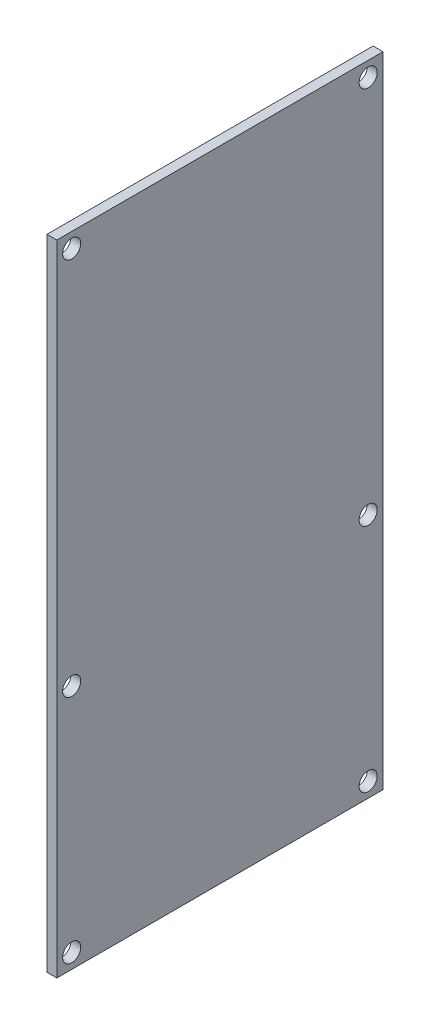
ISO-10303-21;
HEADER;
FILE_DESCRIPTION(('STEP AP214'),'2;1');
FILE_NAME('part.step','',(''),(''),'','','');
FILE_SCHEMA(('AUTOMOTIVE_DESIGN { 1 0 10303 214 1 1 1 1 }'));
ENDSEC;
DATA;
#1=APPLICATION_CONTEXT('core data for automotive mechanical design processes');
#2=APPLICATION_PROTOCOL_DEFINITION('international standard','automotive_design',2000,#1);
#3=PRODUCT_CONTEXT('',#1,'mechanical');
#4=PRODUCT('Part','Part','',(#3));
#5=PRODUCT_RELATED_PRODUCT_CATEGORY('part','',(#4));
#6=PRODUCT_DEFINITION_FORMATION('','',#4);
#7=PRODUCT_DEFINITION_CONTEXT('part definition',#1,'design');
#8=PRODUCT_DEFINITION('design','',#6,#7);
#9=PRODUCT_DEFINITION_SHAPE('','',#8);
#10=(LENGTH_UNIT() NAMED_UNIT(*) SI_UNIT(.MILLI.,.METRE.));
#11=(NAMED_UNIT(*) PLANE_ANGLE_UNIT() SI_UNIT($,.RADIAN.));
#12=(NAMED_UNIT(*) SI_UNIT($,.STERADIAN.) SOLID_ANGLE_UNIT());
#13=UNCERTAINTY_MEASURE_WITH_UNIT(LENGTH_MEASURE(1.E-05),#10,'distance_accuracy_value','');
#14=(GEOMETRIC_REPRESENTATION_CONTEXT(3) GLOBAL_UNCERTAINTY_ASSIGNED_CONTEXT((#13)) GLOBAL_UNIT_ASSIGNED_CONTEXT((#10,
#11,#12)) REPRESENTATION_CONTEXT('',''));
#15=CARTESIAN_POINT('',(0.,0.,0.));
#16=DIRECTION('',(0.,0.,1.));
#17=DIRECTION('',(1.,0.,0.));
#18=AXIS2_PLACEMENT_3D('',#15,#16,#17);
#19=CARTESIAN_POINT('',(48.0117160697982,104.500000000016,33.2693427308272));
#20=DIRECTION('',(0.,-1.,0.));
#21=DIRECTION('',(0.,0.,-1.));
#22=AXIS2_PLACEMENT_3D('',#19,#20,#21);
#23=PLANE('',#22);
#24=DIRECTION('',(0.,0.,1.));
#25=VECTOR('',#24,1.);
#26=CARTESIAN_POINT('',(45.0117160697982,104.500000000016,33.2693427308272));
#27=LINE('',#26,#25);
#28=CARTESIAN_POINT('',(45.0117160697983,104.500000000016,-65.7306572691728));
#29=VERTEX_POINT('',#28);
#30=CARTESIAN_POINT('',(45.0117160697982,104.500000000016,33.2693427308272));
#31=VERTEX_POINT('',#30);
#32=EDGE_CURVE('E96',#29,#31,#27,.T.);
#33=ORIENTED_EDGE('',*,*,#32,.T.);
#34=DIRECTION('',(-1.,0.,0.));
#35=VECTOR('',#34,1.);
#36=CARTESIAN_POINT('',(48.0117160697982,104.500000000016,33.2693427308272));
#37=LINE('',#36,#35);
#38=CARTESIAN_POINT('',(48.0117160697982,104.500000000016,33.2693427308272));
#39=VERTEX_POINT('',#38);
#40=EDGE_CURVE('E11',#39,#31,#37,.T.);
#41=ORIENTED_EDGE('',*,*,#40,.F.);
#42=DIRECTION('',(0.,0.,1.));
#43=VECTOR('',#42,1.);
#44=CARTESIAN_POINT('',(48.0117160697982,104.500000000016,33.2693427308272));
#45=LINE('',#44,#43);
#46=CARTESIAN_POINT('',(48.0117160697983,104.500000000016,-65.7306572691728));
#47=VERTEX_POINT('',#46);
#48=EDGE_CURVE('E84',#47,#39,#45,.T.);
#49=ORIENTED_EDGE('',*,*,#48,.F.);
#50=DIRECTION('',(-1.,0.,0.));
#51=VECTOR('',#50,1.);
#52=CARTESIAN_POINT('',(48.0117160697983,104.500000000016,-65.7306572691728));
#53=LINE('',#52,#51);
#54=EDGE_CURVE('E92',#47,#29,#53,.T.);
#55=ORIENTED_EDGE('',*,*,#54,.T.);
#56=EDGE_LOOP('',(#33,#41,#49,#55));
#57=FACE_BOUND('',#56,.T.);
#58=ADVANCED_FACE('F33',(#57),#23,.F.);
#59=CARTESIAN_POINT('',(48.0117160697982,104.500000000016,33.2693427308272));
#60=DIRECTION('',(0.,0.,-1.));
#61=DIRECTION('',(-1.,0.,0.));
#62=AXIS2_PLACEMENT_3D('',#59,#60,#61);
#63=PLANE('',#62);
#64=DIRECTION('',(0.,-1.,0.));
#65=VECTOR('',#64,1.);
#66=CARTESIAN_POINT('',(45.0117160697982,104.500000000016,33.2693427308272));
#67=LINE('',#66,#65);
#68=CARTESIAN_POINT('',(45.0117160697982,-89.4999999999837,33.2693427308272));
#69=VERTEX_POINT('',#68);
#70=EDGE_CURVE('E88',#31,#69,#67,.T.);
#71=ORIENTED_EDGE('',*,*,#70,.T.);
#72=DIRECTION('',(-1.,0.,0.));
#73=VECTOR('',#72,1.);
#74=CARTESIAN_POINT('',(48.0117160697982,-89.4999999999837,33.2693427308272));
#75=LINE('',#74,#73);
#76=CARTESIAN_POINT('',(48.0117160697982,-89.4999999999837,33.2693427308272));
#77=VERTEX_POINT('',#76);
#78=EDGE_CURVE('E41',#77,#69,#75,.T.);
#79=ORIENTED_EDGE('',*,*,#78,.F.);
#80=DIRECTION('',(0.,-1.,0.));
#81=VECTOR('',#80,1.);
#82=CARTESIAN_POINT('',(48.0117160697982,104.500000000016,33.2693427308272));
#83=LINE('',#82,#81);
#84=EDGE_CURVE('E79',#39,#77,#83,.T.);
#85=ORIENTED_EDGE('',*,*,#84,.F.);
#86=ORIENTED_EDGE('',*,*,#40,.T.);
#87=EDGE_LOOP('',(#71,#79,#85,#86));
#88=FACE_BOUND('',#87,.T.);
#89=ADVANCED_FACE('F87',(#88),#63,.F.);
#90=CARTESIAN_POINT('',(48.0117160697982,-89.4999999999837,33.2693427308272));
#91=DIRECTION('',(0.,1.,0.));
#92=DIRECTION('',(0.,0.,1.));
#93=AXIS2_PLACEMENT_3D('',#90,#91,#92);
#94=PLANE('',#93);
#95=DIRECTION('',(0.,0.,-1.));
#96=VECTOR('',#95,1.);
#97=CARTESIAN_POINT('',(45.0117160697982,-89.4999999999837,33.2693427308272));
#98=LINE('',#97,#96);
#99=CARTESIAN_POINT('',(45.0117160697983,-89.4999999999837,-65.7306572691728));
#100=VERTEX_POINT('',#99);
#101=EDGE_CURVE('E66',#69,#100,#98,.T.);
#102=ORIENTED_EDGE('',*,*,#101,.T.);
#103=DIRECTION('',(-1.,0.,0.));
#104=VECTOR('',#103,1.);
#105=CARTESIAN_POINT('',(48.0117160697983,-89.4999999999837,-65.7306572691728));
#106=LINE('',#105,#104);
#107=CARTESIAN_POINT('',(48.0117160697983,-89.4999999999837,-65.7306572691728));
#108=VERTEX_POINT('',#107);
#109=EDGE_CURVE('E89',#108,#100,#106,.T.);
#110=ORIENTED_EDGE('',*,*,#109,.F.);
#111=DIRECTION('',(0.,0.,-1.));
#112=VECTOR('',#111,1.);
#113=CARTESIAN_POINT('',(48.0117160697982,-89.4999999999837,33.2693427308272));
#114=LINE('',#113,#112);
#115=EDGE_CURVE('E82',#77,#108,#114,.T.);
#116=ORIENTED_EDGE('',*,*,#115,.F.);
#117=ORIENTED_EDGE('',*,*,#78,.T.);
#118=EDGE_LOOP('',(#102,#110,#116,#117));
#119=FACE_BOUND('',#118,.T.);
#120=ADVANCED_FACE('F90',(#119),#94,.F.);
#121=CARTESIAN_POINT('',(48.0117160697983,104.500000000016,-65.7306572691728));
#122=DIRECTION('',(0.,0.,1.));
#123=DIRECTION('',(1.,0.,0.));
#124=AXIS2_PLACEMENT_3D('',#121,#122,#123);
#125=PLANE('',#124);
#126=DIRECTION('',(0.,1.,0.));
#127=VECTOR('',#126,1.);
#128=CARTESIAN_POINT('',(45.0117160697983,104.500000000016,-65.7306572691728));
#129=LINE('',#128,#127);
#130=EDGE_CURVE('E72',#100,#29,#129,.T.);
#131=ORIENTED_EDGE('',*,*,#130,.T.);
#132=ORIENTED_EDGE('',*,*,#54,.F.);
#133=DIRECTION('',(0.,1.,0.));
#134=VECTOR('',#133,1.);
#135=CARTESIAN_POINT('',(48.0117160697983,104.500000000016,-65.7306572691728));
#136=LINE('',#135,#134);
#137=EDGE_CURVE('E49',#108,#47,#136,.T.);
#138=ORIENTED_EDGE('',*,*,#137,.F.);
#139=ORIENTED_EDGE('',*,*,#109,.T.);
#140=EDGE_LOOP('',(#131,#132,#138,#139));
#141=FACE_BOUND('',#140,.T.);
#142=ADVANCED_FACE('F104',(#141),#125,.F.);
#143=CARTESIAN_POINT('',(48.0117160697983,104.500000000016,-65.7306572691728));
#144=DIRECTION('',(-1.,0.,0.));
#145=DIRECTION('',(0.,0.,1.));
#146=AXIS2_PLACEMENT_3D('',#143,#144,#145);
#147=PLANE('',#146);
#148=CARTESIAN_POINT('',(48.0117160697983,-14.9999999999837,-61.2306572691728));
#149=DIRECTION('',(1.,0.,0.));
#150=DIRECTION('',(0.,1.,0.));
#151=AXIS2_PLACEMENT_3D('',#148,#149,#150);
#152=CIRCLE('',#151,2.75000000000001);
#153=CARTESIAN_POINT('',(48.0117160697983,-12.2499999999837,-61.2306572691728));
#154=VERTEX_POINT('',#153);
#155=EDGE_CURVE('E140',#154,#154,#152,.T.);
#156=ORIENTED_EDGE('',*,*,#155,.F.);
#157=EDGE_LOOP('',(#156));
#158=FACE_BOUND('',#157,.T.);
#159=CARTESIAN_POINT('',(48.0117160697983,-14.9999999999837,28.7693427308272));
#160=DIRECTION('',(1.,0.,0.));
#161=DIRECTION('',(0.,1.,0.));
#162=AXIS2_PLACEMENT_3D('',#159,#160,#161);
#163=CIRCLE('',#162,2.75);
#164=CARTESIAN_POINT('',(48.0117160697983,-12.2499999999837,28.7693427308272));
#165=VERTEX_POINT('',#164);
#166=EDGE_CURVE('E134',#165,#165,#163,.T.);
#167=ORIENTED_EDGE('',*,*,#166,.F.);
#168=EDGE_LOOP('',(#167));
#169=FACE_BOUND('',#168,.T.);
#170=CARTESIAN_POINT('',(48.0117160697983,-84.9999999999837,-61.2306572691728));
#171=DIRECTION('',(1.,0.,0.));
#172=DIRECTION('',(0.,1.,0.));
#173=AXIS2_PLACEMENT_3D('',#170,#171,#172);
#174=CIRCLE('',#173,2.75000000000001);
#175=CARTESIAN_POINT('',(48.0117160697983,-82.2499999999837,-61.2306572691728));
#176=VERTEX_POINT('',#175);
#177=EDGE_CURVE('E128',#176,#176,#174,.T.);
#178=ORIENTED_EDGE('',*,*,#177,.F.);
#179=EDGE_LOOP('',(#178));
#180=FACE_BOUND('',#179,.T.);
#181=CARTESIAN_POINT('',(48.0117160697983,-84.9999999999837,28.7693427308272));
#182=DIRECTION('',(1.,0.,0.));
#183=DIRECTION('',(0.,1.,0.));
#184=AXIS2_PLACEMENT_3D('',#181,#182,#183);
#185=CIRCLE('',#184,2.75);
#186=CARTESIAN_POINT('',(48.0117160697983,-82.2499999999837,28.7693427308272));
#187=VERTEX_POINT('',#186);
#188=EDGE_CURVE('E122',#187,#187,#185,.T.);
#189=ORIENTED_EDGE('',*,*,#188,.F.);
#190=EDGE_LOOP('',(#189));
#191=FACE_BOUND('',#190,.T.);
#192=CARTESIAN_POINT('',(48.0117160697982,100.000000000016,-61.2306572691728));
#193=DIRECTION('',(1.,0.,0.));
#194=DIRECTION('',(0.,1.,0.));
#195=AXIS2_PLACEMENT_3D('',#192,#193,#194);
#196=CIRCLE('',#195,2.75000000000001);
#197=CARTESIAN_POINT('',(48.0117160697982,102.750000000016,-61.2306572691728));
#198=VERTEX_POINT('',#197);
#199=EDGE_CURVE('E116',#198,#198,#196,.T.);
#200=ORIENTED_EDGE('',*,*,#199,.F.);
#201=EDGE_LOOP('',(#200));
#202=FACE_BOUND('',#201,.T.);
#203=CARTESIAN_POINT('',(48.0117160697982,100.000000000016,28.7693427308272));
#204=DIRECTION('',(1.,0.,0.));
#205=DIRECTION('',(0.,1.,0.));
#206=AXIS2_PLACEMENT_3D('',#203,#204,#205);
#207=CIRCLE('',#206,2.75);
#208=CARTESIAN_POINT('',(48.0117160697982,102.750000000016,28.7693427308272));
#209=VERTEX_POINT('',#208);
#210=EDGE_CURVE('E110',#209,#209,#207,.T.);
#211=ORIENTED_EDGE('',*,*,#210,.F.);
#212=EDGE_LOOP('',(#211));
#213=FACE_BOUND('',#212,.T.);
#214=ORIENTED_EDGE('',*,*,#48,.T.);
#215=ORIENTED_EDGE('',*,*,#84,.T.);
#216=ORIENTED_EDGE('',*,*,#115,.T.);
#217=ORIENTED_EDGE('',*,*,#137,.T.);
#218=EDGE_LOOP('',(#214,#215,#216,#217));
#219=FACE_BOUND('',#218,.T.);
#220=ADVANCED_FACE('F80',(#158,#169,#180,#191,#202,#213,#219),#147,.F.);
#221=CARTESIAN_POINT('',(45.0117160697983,104.500000000016,-65.7306572691728));
#222=DIRECTION('',(-1.,0.,0.));
#223=DIRECTION('',(0.,0.,1.));
#224=AXIS2_PLACEMENT_3D('',#221,#222,#223);
#225=PLANE('',#224);
#226=CARTESIAN_POINT('',(45.0117160697982,-14.9999999999837,-61.2306572691728));
#227=DIRECTION('',(1.,0.,0.));
#228=DIRECTION('',(0.,1.,0.));
#229=AXIS2_PLACEMENT_3D('',#226,#227,#228);
#230=CIRCLE('',#229,2.75000000000001);
#231=CARTESIAN_POINT('',(45.0117160697982,-12.2499999999837,-61.2306572691728));
#232=VERTEX_POINT('',#231);
#233=EDGE_CURVE('E137',#232,#232,#230,.T.);
#234=ORIENTED_EDGE('',*,*,#233,.T.);
#235=EDGE_LOOP('',(#234));
#236=FACE_BOUND('',#235,.T.);
#237=CARTESIAN_POINT('',(45.0117160697982,-14.9999999999837,28.7693427308272));
#238=DIRECTION('',(1.,0.,0.));
#239=DIRECTION('',(0.,1.,0.));
#240=AXIS2_PLACEMENT_3D('',#237,#238,#239);
#241=CIRCLE('',#240,2.75);
#242=CARTESIAN_POINT('',(45.0117160697982,-12.2499999999837,28.7693427308272));
#243=VERTEX_POINT('',#242);
#244=EDGE_CURVE('E131',#243,#243,#241,.T.);
#245=ORIENTED_EDGE('',*,*,#244,.T.);
#246=EDGE_LOOP('',(#245));
#247=FACE_BOUND('',#246,.T.);
#248=CARTESIAN_POINT('',(45.0117160697982,-84.9999999999837,-61.2306572691728));
#249=DIRECTION('',(1.,0.,0.));
#250=DIRECTION('',(0.,1.,0.));
#251=AXIS2_PLACEMENT_3D('',#248,#249,#250);
#252=CIRCLE('',#251,2.75000000000001);
#253=CARTESIAN_POINT('',(45.0117160697982,-82.2499999999837,-61.2306572691728));
#254=VERTEX_POINT('',#253);
#255=EDGE_CURVE('E125',#254,#254,#252,.T.);
#256=ORIENTED_EDGE('',*,*,#255,.T.);
#257=EDGE_LOOP('',(#256));
#258=FACE_BOUND('',#257,.T.);
#259=CARTESIAN_POINT('',(45.0117160697982,-84.9999999999837,28.7693427308272));
#260=DIRECTION('',(1.,0.,0.));
#261=DIRECTION('',(0.,1.,0.));
#262=AXIS2_PLACEMENT_3D('',#259,#260,#261);
#263=CIRCLE('',#262,2.75);
#264=CARTESIAN_POINT('',(45.0117160697982,-82.2499999999837,28.7693427308272));
#265=VERTEX_POINT('',#264);
#266=EDGE_CURVE('E119',#265,#265,#263,.T.);
#267=ORIENTED_EDGE('',*,*,#266,.T.);
#268=EDGE_LOOP('',(#267));
#269=FACE_BOUND('',#268,.T.);
#270=CARTESIAN_POINT('',(45.0117160697982,100.000000000016,-61.2306572691728));
#271=DIRECTION('',(1.,0.,0.));
#272=DIRECTION('',(0.,1.,0.));
#273=AXIS2_PLACEMENT_3D('',#270,#271,#272);
#274=CIRCLE('',#273,2.75000000000001);
#275=CARTESIAN_POINT('',(45.0117160697982,102.750000000016,-61.2306572691728));
#276=VERTEX_POINT('',#275);
#277=EDGE_CURVE('E113',#276,#276,#274,.T.);
#278=ORIENTED_EDGE('',*,*,#277,.T.);
#279=EDGE_LOOP('',(#278));
#280=FACE_BOUND('',#279,.T.);
#281=CARTESIAN_POINT('',(45.0117160697982,100.000000000016,28.7693427308272));
#282=DIRECTION('',(1.,0.,0.));
#283=DIRECTION('',(0.,1.,0.));
#284=AXIS2_PLACEMENT_3D('',#281,#282,#283);
#285=CIRCLE('',#284,2.75);
#286=CARTESIAN_POINT('',(45.0117160697982,102.750000000016,28.7693427308272));
#287=VERTEX_POINT('',#286);
#288=EDGE_CURVE('E99',#287,#287,#285,.T.);
#289=ORIENTED_EDGE('',*,*,#288,.T.);
#290=EDGE_LOOP('',(#289));
#291=FACE_BOUND('',#290,.T.);
#292=ORIENTED_EDGE('',*,*,#32,.F.);
#293=ORIENTED_EDGE('',*,*,#130,.F.);
#294=ORIENTED_EDGE('',*,*,#101,.F.);
#295=ORIENTED_EDGE('',*,*,#70,.F.);
#296=EDGE_LOOP('',(#292,#293,#294,#295));
#297=FACE_BOUND('',#296,.T.);
#298=ADVANCED_FACE('F107',(#236,#247,#258,#269,#280,#291,#297),#225,.T.);
#299=CARTESIAN_POINT('',(45.0117160697982,100.000000000016,28.7693427308272));
#300=DIRECTION('',(1.,0.,0.));
#301=DIRECTION('',(0.,1.,0.));
#302=AXIS2_PLACEMENT_3D('',#299,#300,#301);
#303=CYLINDRICAL_SURFACE('',#302,2.75);
#304=ORIENTED_EDGE('',*,*,#288,.F.);
#305=EDGE_LOOP('',(#304));
#306=FACE_BOUND('',#305,.T.);
#307=ORIENTED_EDGE('',*,*,#210,.T.);
#308=EDGE_LOOP('',(#307));
#309=FACE_BOUND('',#308,.T.);
#310=ADVANCED_FACE('F168',(#306,#309),#303,.F.);
#311=CARTESIAN_POINT('',(45.0117160697982,100.000000000016,-61.2306572691728));
#312=DIRECTION('',(1.,0.,0.));
#313=DIRECTION('',(0.,1.,0.));
#314=AXIS2_PLACEMENT_3D('',#311,#312,#313);
#315=CYLINDRICAL_SURFACE('',#314,2.75000000000001);
#316=ORIENTED_EDGE('',*,*,#277,.F.);
#317=EDGE_LOOP('',(#316));
#318=FACE_BOUND('',#317,.T.);
#319=ORIENTED_EDGE('',*,*,#199,.T.);
#320=EDGE_LOOP('',(#319));
#321=FACE_BOUND('',#320,.T.);
#322=ADVANCED_FACE('F170',(#318,#321),#315,.F.);
#323=CARTESIAN_POINT('',(45.0117160697982,-84.9999999999837,28.7693427308272));
#324=DIRECTION('',(1.,0.,0.));
#325=DIRECTION('',(0.,1.,0.));
#326=AXIS2_PLACEMENT_3D('',#323,#324,#325);
#327=CYLINDRICAL_SURFACE('',#326,2.75);
#328=ORIENTED_EDGE('',*,*,#266,.F.);
#329=EDGE_LOOP('',(#328));
#330=FACE_BOUND('',#329,.T.);
#331=ORIENTED_EDGE('',*,*,#188,.T.);
#332=EDGE_LOOP('',(#331));
#333=FACE_BOUND('',#332,.T.);
#334=ADVANCED_FACE('F177',(#330,#333),#327,.F.);
#335=CARTESIAN_POINT('',(45.0117160697982,-84.9999999999837,-61.2306572691728));
#336=DIRECTION('',(1.,0.,0.));
#337=DIRECTION('',(0.,1.,0.));
#338=AXIS2_PLACEMENT_3D('',#335,#336,#337);
#339=CYLINDRICAL_SURFACE('',#338,2.75000000000001);
#340=ORIENTED_EDGE('',*,*,#255,.F.);
#341=EDGE_LOOP('',(#340));
#342=FACE_BOUND('',#341,.T.);
#343=ORIENTED_EDGE('',*,*,#177,.T.);
#344=EDGE_LOOP('',(#343));
#345=FACE_BOUND('',#344,.T.);
#346=ADVANCED_FACE('F223',(#342,#345),#339,.F.);
#347=CARTESIAN_POINT('',(45.0117160697982,-14.9999999999837,28.7693427308272));
#348=DIRECTION('',(1.,0.,0.));
#349=DIRECTION('',(0.,1.,0.));
#350=AXIS2_PLACEMENT_3D('',#347,#348,#349);
#351=CYLINDRICAL_SURFACE('',#350,2.75);
#352=ORIENTED_EDGE('',*,*,#244,.F.);
#353=EDGE_LOOP('',(#352));
#354=FACE_BOUND('',#353,.T.);
#355=ORIENTED_EDGE('',*,*,#166,.T.);
#356=EDGE_LOOP('',(#355));
#357=FACE_BOUND('',#356,.T.);
#358=ADVANCED_FACE('F151',(#354,#357),#351,.F.);
#359=CARTESIAN_POINT('',(45.0117160697982,-14.9999999999837,-61.2306572691728));
#360=DIRECTION('',(1.,0.,0.));
#361=DIRECTION('',(0.,1.,0.));
#362=AXIS2_PLACEMENT_3D('',#359,#360,#361);
#363=CYLINDRICAL_SURFACE('',#362,2.75000000000001);
#364=ORIENTED_EDGE('',*,*,#233,.F.);
#365=EDGE_LOOP('',(#364));
#366=FACE_BOUND('',#365,.T.);
#367=ORIENTED_EDGE('',*,*,#155,.T.);
#368=EDGE_LOOP('',(#367));
#369=FACE_BOUND('',#368,.T.);
#370=ADVANCED_FACE('F148',(#366,#369),#363,.F.);
#371=CLOSED_SHELL('',(#58,#89,#120,#142,#220,#298,#310,#322,#334,#346,#358,#370));
#372=MANIFOLD_SOLID_BREP('B2',#371);
#373=ADVANCED_BREP_SHAPE_REPRESENTATION('',(#18,#372),#14);
#374=SHAPE_DEFINITION_REPRESENTATION(#9,#373);
ENDSEC;
END-ISO-10303-21;
